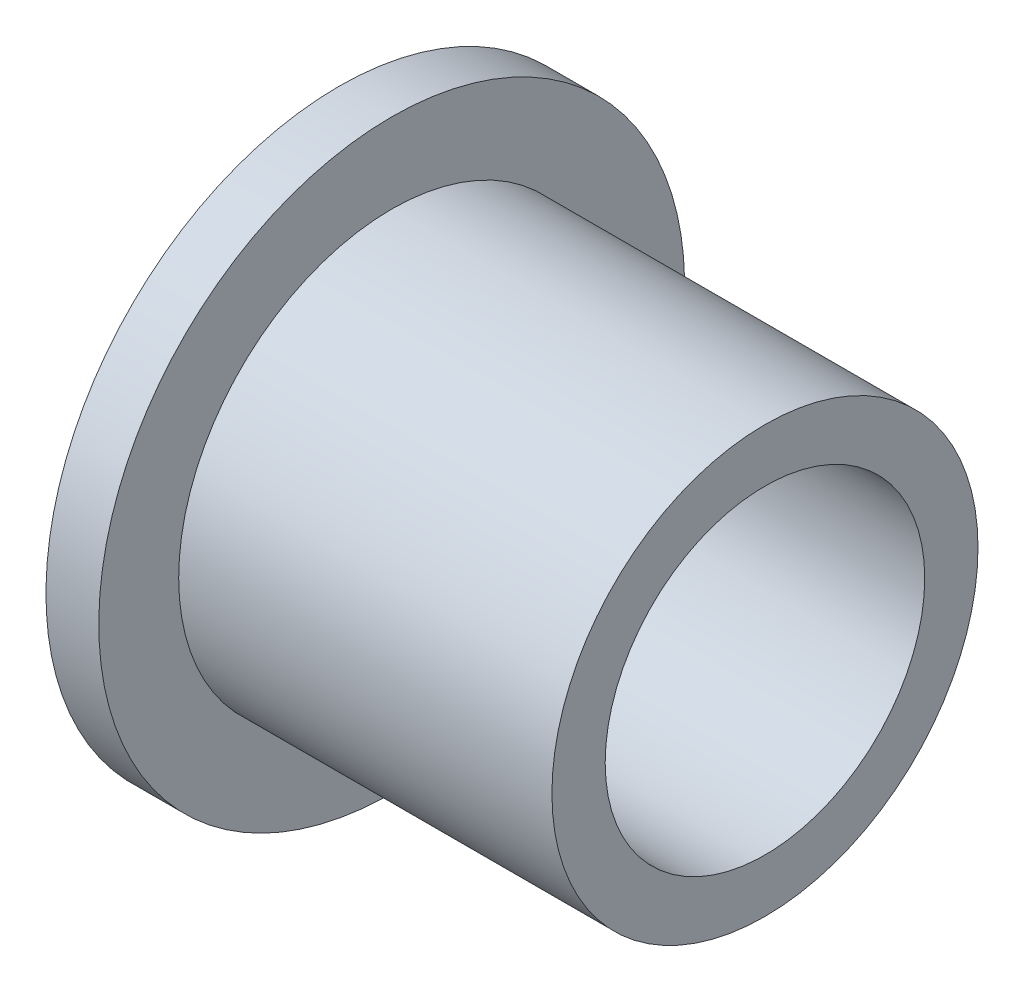
ISO-10303-21;
HEADER;
FILE_DESCRIPTION(('STEP AP214'),'2;1');
FILE_NAME('part.step','',(''),(''),'','','');
FILE_SCHEMA(('AUTOMOTIVE_DESIGN { 1 0 10303 214 1 1 1 1 }'));
ENDSEC;
DATA;
#1=APPLICATION_CONTEXT('core data for automotive mechanical design processes');
#2=APPLICATION_PROTOCOL_DEFINITION('international standard','automotive_design',2000,#1);
#3=PRODUCT_CONTEXT('',#1,'mechanical');
#4=PRODUCT('Part','Part','',(#3));
#5=PRODUCT_RELATED_PRODUCT_CATEGORY('part','',(#4));
#6=PRODUCT_DEFINITION_FORMATION('','',#4);
#7=PRODUCT_DEFINITION_CONTEXT('part definition',#1,'design');
#8=PRODUCT_DEFINITION('design','',#6,#7);
#9=PRODUCT_DEFINITION_SHAPE('','',#8);
#10=(LENGTH_UNIT() NAMED_UNIT(*) SI_UNIT(.MILLI.,.METRE.));
#11=(NAMED_UNIT(*) PLANE_ANGLE_UNIT() SI_UNIT($,.RADIAN.));
#12=(NAMED_UNIT(*) SI_UNIT($,.STERADIAN.) SOLID_ANGLE_UNIT());
#13=UNCERTAINTY_MEASURE_WITH_UNIT(LENGTH_MEASURE(1.E-05),#10,'distance_accuracy_value','');
#14=(GEOMETRIC_REPRESENTATION_CONTEXT(3) GLOBAL_UNCERTAINTY_ASSIGNED_CONTEXT((#13)) GLOBAL_UNIT_ASSIGNED_CONTEXT((#10,
#11,#12)) REPRESENTATION_CONTEXT('',''));
#15=CARTESIAN_POINT('',(0.,0.,0.));
#16=DIRECTION('',(0.,0.,1.));
#17=DIRECTION('',(1.,0.,0.));
#18=AXIS2_PLACEMENT_3D('',#15,#16,#17);
#19=CARTESIAN_POINT('',(0.,4.365625,0.));
#20=DIRECTION('',(-1.,0.,0.));
#21=DIRECTION('',(0.,0.,1.));
#22=AXIS2_PLACEMENT_3D('',#19,#20,#21);
#23=PLANE('',#22);
#24=CARTESIAN_POINT('',(0.,0.,0.));
#25=DIRECTION('',(-1.,0.,0.));
#26=DIRECTION('',(0.,0.,1.));
#27=AXIS2_PLACEMENT_3D('',#24,#25,#26);
#28=CIRCLE('',#27,4.7625);
#29=CARTESIAN_POINT('',(0.,0.,4.7625));
#30=VERTEX_POINT('',#29);
#31=EDGE_CURVE('E19',#30,#30,#28,.F.);
#32=ORIENTED_EDGE('',*,*,#31,.T.);
#33=EDGE_LOOP('',(#32));
#34=FACE_BOUND('',#33,.T.);
#35=CARTESIAN_POINT('',(0.,0.,0.));
#36=DIRECTION('',(1.,0.,0.));
#37=DIRECTION('',(0.,1.,0.));
#38=AXIS2_PLACEMENT_3D('',#35,#36,#37);
#39=CIRCLE('',#38,8.73125);
#40=CARTESIAN_POINT('',(0.,8.73125,0.));
#41=VERTEX_POINT('',#40);
#42=EDGE_CURVE('E35',#41,#41,#39,.T.);
#43=ORIENTED_EDGE('',*,*,#42,.F.);
#44=EDGE_LOOP('',(#43));
#45=FACE_BOUND('',#44,.T.);
#46=ADVANCED_FACE('F15',(#34,#45),#23,.T.);
#47=CARTESIAN_POINT('',(12.7,0.,0.));
#48=DIRECTION('',(-1.,0.,0.));
#49=DIRECTION('',(0.,0.,1.));
#50=AXIS2_PLACEMENT_3D('',#47,#48,#49);
#51=CYLINDRICAL_SURFACE('',#50,4.7625);
#52=CARTESIAN_POINT('',(12.7,0.,0.));
#53=DIRECTION('',(-1.,0.,0.));
#54=DIRECTION('',(0.,0.,1.));
#55=AXIS2_PLACEMENT_3D('',#52,#53,#54);
#56=CIRCLE('',#55,4.7625);
#57=CARTESIAN_POINT('',(12.7,0.,4.7625));
#58=VERTEX_POINT('',#57);
#59=EDGE_CURVE('E33',#58,#58,#56,.T.);
#60=ORIENTED_EDGE('',*,*,#59,.F.);
#61=EDGE_LOOP('',(#60));
#62=FACE_BOUND('',#61,.T.);
#63=ORIENTED_EDGE('',*,*,#31,.F.);
#64=EDGE_LOOP('',(#63));
#65=FACE_BOUND('',#64,.T.);
#66=ADVANCED_FACE('F17',(#62,#65),#51,.F.);
#67=CARTESIAN_POINT('',(0.7874,0.,0.));
#68=DIRECTION('',(1.,0.,0.));
#69=DIRECTION('',(0.,1.,0.));
#70=AXIS2_PLACEMENT_3D('',#67,#68,#69);
#71=CYLINDRICAL_SURFACE('',#70,8.73125);
#72=ORIENTED_EDGE('',*,*,#42,.T.);
#73=EDGE_LOOP('',(#72));
#74=FACE_BOUND('',#73,.T.);
#75=CARTESIAN_POINT('',(1.5748,0.,0.));
#76=DIRECTION('',(1.,0.,0.));
#77=DIRECTION('',(0.,1.,0.));
#78=AXIS2_PLACEMENT_3D('',#75,#76,#77);
#79=CIRCLE('',#78,8.73125);
#80=CARTESIAN_POINT('',(1.5748,8.73125,0.));
#81=VERTEX_POINT('',#80);
#82=EDGE_CURVE('E28',#81,#81,#79,.T.);
#83=ORIENTED_EDGE('',*,*,#82,.F.);
#84=EDGE_LOOP('',(#83));
#85=FACE_BOUND('',#84,.T.);
#86=ADVANCED_FACE('F45',(#74,#85),#71,.T.);
#87=CARTESIAN_POINT('',(12.7,3.175,0.));
#88=DIRECTION('',(1.,0.,0.));
#89=DIRECTION('',(0.,0.,-1.));
#90=AXIS2_PLACEMENT_3D('',#87,#88,#89);
#91=PLANE('',#90);
#92=ORIENTED_EDGE('',*,*,#59,.T.);
#93=EDGE_LOOP('',(#92));
#94=FACE_BOUND('',#93,.T.);
#95=CARTESIAN_POINT('',(12.7,0.,0.));
#96=DIRECTION('',(1.,0.,0.));
#97=DIRECTION('',(0.,1.,0.));
#98=AXIS2_PLACEMENT_3D('',#95,#96,#97);
#99=CIRCLE('',#98,6.35);
#100=CARTESIAN_POINT('',(12.7,6.35,0.));
#101=VERTEX_POINT('',#100);
#102=EDGE_CURVE('E23',#101,#101,#99,.F.);
#103=ORIENTED_EDGE('',*,*,#102,.F.);
#104=EDGE_LOOP('',(#103));
#105=FACE_BOUND('',#104,.T.);
#106=ADVANCED_FACE('F52',(#94,#105),#91,.T.);
#107=CARTESIAN_POINT('',(1.5748,7.540625,0.));
#108=DIRECTION('',(1.,0.,0.));
#109=DIRECTION('',(0.,0.,-1.));
#110=AXIS2_PLACEMENT_3D('',#107,#108,#109);
#111=PLANE('',#110);
#112=CARTESIAN_POINT('',(1.5748,0.,0.));
#113=DIRECTION('',(1.,0.,0.));
#114=DIRECTION('',(0.,1.,0.));
#115=AXIS2_PLACEMENT_3D('',#112,#113,#114);
#116=CIRCLE('',#115,6.35);
#117=CARTESIAN_POINT('',(1.5748,6.35,0.));
#118=VERTEX_POINT('',#117);
#119=EDGE_CURVE('E10',#118,#118,#116,.T.);
#120=ORIENTED_EDGE('',*,*,#119,.F.);
#121=EDGE_LOOP('',(#120));
#122=FACE_BOUND('',#121,.T.);
#123=ORIENTED_EDGE('',*,*,#82,.T.);
#124=EDGE_LOOP('',(#123));
#125=FACE_BOUND('',#124,.T.);
#126=ADVANCED_FACE('F57',(#122,#125),#111,.T.);
#127=CARTESIAN_POINT('',(7.1374,0.,0.));
#128=DIRECTION('',(1.,0.,0.));
#129=DIRECTION('',(0.,1.,0.));
#130=AXIS2_PLACEMENT_3D('',#127,#128,#129);
#131=CYLINDRICAL_SURFACE('',#130,6.35);
#132=ORIENTED_EDGE('',*,*,#119,.T.);
#133=EDGE_LOOP('',(#132));
#134=FACE_BOUND('',#133,.T.);
#135=ORIENTED_EDGE('',*,*,#102,.T.);
#136=EDGE_LOOP('',(#135));
#137=FACE_BOUND('',#136,.T.);
#138=ADVANCED_FACE('F55',(#134,#137),#131,.T.);
#139=CLOSED_SHELL('',(#46,#66,#86,#106,#126,#138));
#140=MANIFOLD_SOLID_BREP('B1',#139);
#141=ADVANCED_BREP_SHAPE_REPRESENTATION('',(#18,#140),#14);
#142=SHAPE_DEFINITION_REPRESENTATION(#9,#141);
ENDSEC;
END-ISO-10303-21;
